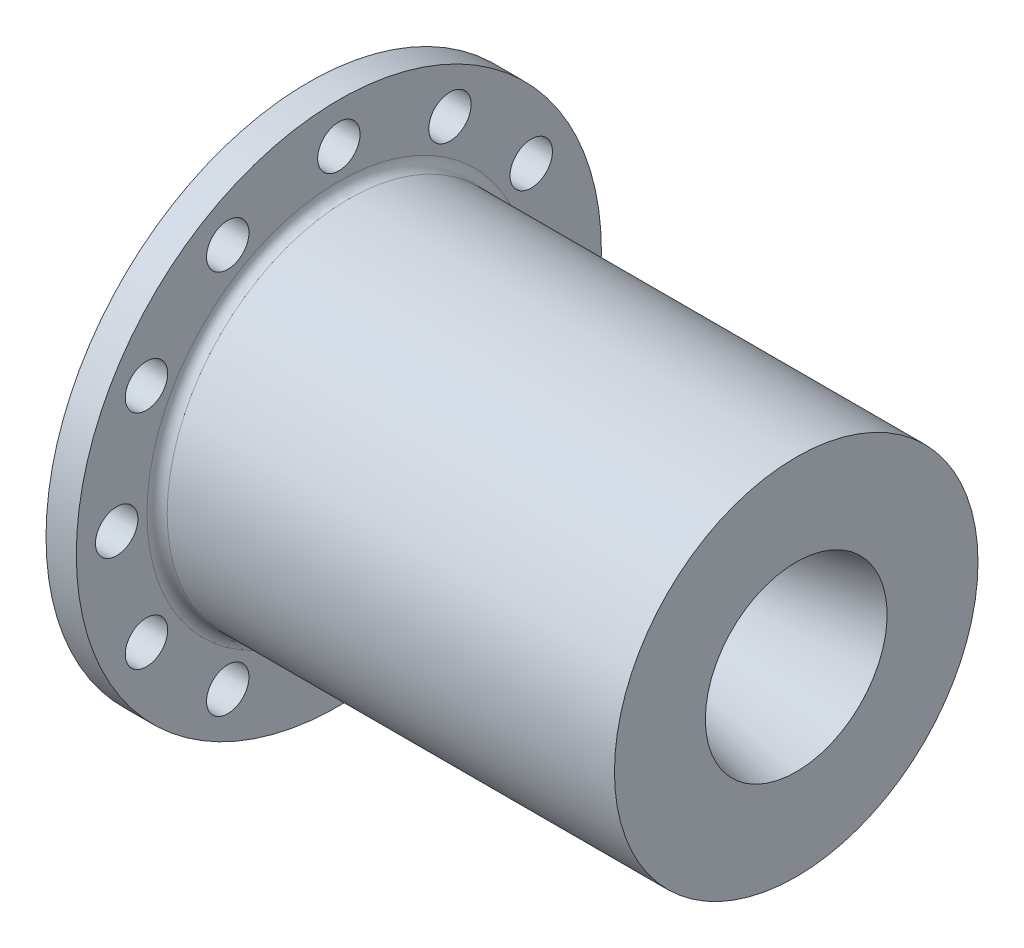
ISO-10303-21;
HEADER;
FILE_DESCRIPTION(('STEP AP214'),'2;1');
FILE_NAME('part.step','',(''),(''),'','','');
FILE_SCHEMA(('AUTOMOTIVE_DESIGN { 1 0 10303 214 1 1 1 1 }'));
ENDSEC;
DATA;
#1=APPLICATION_CONTEXT('core data for automotive mechanical design processes');
#2=APPLICATION_PROTOCOL_DEFINITION('international standard','automotive_design',2000,#1);
#3=PRODUCT_CONTEXT('',#1,'mechanical');
#4=PRODUCT('Part','Part','',(#3));
#5=PRODUCT_RELATED_PRODUCT_CATEGORY('part','',(#4));
#6=PRODUCT_DEFINITION_FORMATION('','',#4);
#7=PRODUCT_DEFINITION_CONTEXT('part definition',#1,'design');
#8=PRODUCT_DEFINITION('design','',#6,#7);
#9=PRODUCT_DEFINITION_SHAPE('','',#8);
#10=(LENGTH_UNIT() NAMED_UNIT(*) SI_UNIT(.MILLI.,.METRE.));
#11=(NAMED_UNIT(*) PLANE_ANGLE_UNIT() SI_UNIT($,.RADIAN.));
#12=(NAMED_UNIT(*) SI_UNIT($,.STERADIAN.) SOLID_ANGLE_UNIT());
#13=UNCERTAINTY_MEASURE_WITH_UNIT(LENGTH_MEASURE(1.E-05),#10,'distance_accuracy_value','');
#14=(GEOMETRIC_REPRESENTATION_CONTEXT(3) GLOBAL_UNCERTAINTY_ASSIGNED_CONTEXT((#13)) GLOBAL_UNIT_ASSIGNED_CONTEXT((#10,
#11,#12)) REPRESENTATION_CONTEXT('',''));
#15=CARTESIAN_POINT('',(0.,0.,0.));
#16=DIRECTION('',(0.,0.,1.));
#17=DIRECTION('',(1.,0.,0.));
#18=AXIS2_PLACEMENT_3D('',#15,#16,#17);
#19=CARTESIAN_POINT('',(3.81,33.02,0.));
#20=DIRECTION('',(-1.,0.,0.));
#21=DIRECTION('',(0.,0.,1.));
#22=AXIS2_PLACEMENT_3D('',#19,#20,#21);
#23=PLANE('',#22);
#24=CARTESIAN_POINT('',(3.81,13.9699999999999,-24.1967497817372));
#25=DIRECTION('',(-1.,0.,0.));
#26=DIRECTION('',(0.,0.,1.));
#27=AXIS2_PLACEMENT_3D('',#24,#25,#26);
#28=CIRCLE('',#27,2.667);
#29=CARTESIAN_POINT('',(3.81,13.9699999999999,-21.5297497817372));
#30=VERTEX_POINT('',#29);
#31=EDGE_CURVE('E103',#30,#30,#28,.F.);
#32=ORIENTED_EDGE('',*,*,#31,.F.);
#33=EDGE_LOOP('',(#32));
#34=FACE_BOUND('',#33,.T.);
#35=CARTESIAN_POINT('',(3.81,0.,-27.94));
#36=DIRECTION('',(-1.,0.,0.));
#37=DIRECTION('',(0.,0.,1.));
#38=AXIS2_PLACEMENT_3D('',#35,#36,#37);
#39=CIRCLE('',#38,2.667);
#40=CARTESIAN_POINT('',(3.81,0.,-25.273));
#41=VERTEX_POINT('',#40);
#42=EDGE_CURVE('E142',#41,#41,#39,.F.);
#43=ORIENTED_EDGE('',*,*,#42,.F.);
#44=EDGE_LOOP('',(#43));
#45=FACE_BOUND('',#44,.T.);
#46=CARTESIAN_POINT('',(3.81,-13.9700000000001,-24.1967497817372));
#47=DIRECTION('',(-1.,0.,0.));
#48=DIRECTION('',(0.,0.,1.));
#49=AXIS2_PLACEMENT_3D('',#46,#47,#48);
#50=CIRCLE('',#49,2.667);
#51=CARTESIAN_POINT('',(3.81,-13.9700000000001,-21.5297497817372));
#52=VERTEX_POINT('',#51);
#53=EDGE_CURVE('E136',#52,#52,#50,.F.);
#54=ORIENTED_EDGE('',*,*,#53,.F.);
#55=EDGE_LOOP('',(#54));
#56=FACE_BOUND('',#55,.T.);
#57=CARTESIAN_POINT('',(3.81,-24.1967497817373,-13.9699999999999));
#58=DIRECTION('',(-1.,0.,0.));
#59=DIRECTION('',(0.,0.,1.));
#60=AXIS2_PLACEMENT_3D('',#57,#58,#59);
#61=CIRCLE('',#60,2.667);
#62=CARTESIAN_POINT('',(3.81,-24.1967497817373,-11.3029999999999));
#63=VERTEX_POINT('',#62);
#64=EDGE_CURVE('E130',#63,#63,#61,.F.);
#65=ORIENTED_EDGE('',*,*,#64,.F.);
#66=EDGE_LOOP('',(#65));
#67=FACE_BOUND('',#66,.T.);
#68=CARTESIAN_POINT('',(3.81,-27.94,0.));
#69=DIRECTION('',(-1.,0.,0.));
#70=DIRECTION('',(0.,0.,1.));
#71=AXIS2_PLACEMENT_3D('',#68,#69,#70);
#72=CIRCLE('',#71,2.667);
#73=CARTESIAN_POINT('',(3.81,-27.94,2.667));
#74=VERTEX_POINT('',#73);
#75=EDGE_CURVE('E124',#74,#74,#72,.F.);
#76=ORIENTED_EDGE('',*,*,#75,.F.);
#77=EDGE_LOOP('',(#76));
#78=FACE_BOUND('',#77,.T.);
#79=CARTESIAN_POINT('',(3.81,-24.1967497817371,13.9700000000002));
#80=DIRECTION('',(-1.,0.,0.));
#81=DIRECTION('',(0.,0.,1.));
#82=AXIS2_PLACEMENT_3D('',#79,#80,#81);
#83=CIRCLE('',#82,2.667);
#84=CARTESIAN_POINT('',(3.81,-24.1967497817371,16.6370000000002));
#85=VERTEX_POINT('',#84);
#86=EDGE_CURVE('E118',#85,#85,#83,.F.);
#87=ORIENTED_EDGE('',*,*,#86,.F.);
#88=EDGE_LOOP('',(#87));
#89=FACE_BOUND('',#88,.T.);
#90=CARTESIAN_POINT('',(3.81,-13.9699999999998,24.1967497817373));
#91=DIRECTION('',(-1.,0.,0.));
#92=DIRECTION('',(0.,0.,1.));
#93=AXIS2_PLACEMENT_3D('',#90,#91,#92);
#94=CIRCLE('',#93,2.667);
#95=CARTESIAN_POINT('',(3.81,-13.9699999999998,26.8637497817373));
#96=VERTEX_POINT('',#95);
#97=EDGE_CURVE('E112',#96,#96,#94,.F.);
#98=ORIENTED_EDGE('',*,*,#97,.F.);
#99=EDGE_LOOP('',(#98));
#100=FACE_BOUND('',#99,.T.);
#101=CARTESIAN_POINT('',(3.81,2.92655965821831E-13,27.94));
#102=DIRECTION('',(-1.,0.,0.));
#103=DIRECTION('',(0.,0.,1.));
#104=AXIS2_PLACEMENT_3D('',#101,#102,#103);
#105=CIRCLE('',#104,2.667);
#106=CARTESIAN_POINT('',(3.81,2.92655965821831E-13,30.607));
#107=VERTEX_POINT('',#106);
#108=EDGE_CURVE('E104',#107,#107,#105,.F.);
#109=ORIENTED_EDGE('',*,*,#108,.F.);
#110=EDGE_LOOP('',(#109));
#111=FACE_BOUND('',#110,.T.);
#112=CARTESIAN_POINT('',(3.81,13.9700000000003,24.1967497817371));
#113=DIRECTION('',(-1.,0.,0.));
#114=DIRECTION('',(0.,0.,1.));
#115=AXIS2_PLACEMENT_3D('',#112,#113,#114);
#116=CIRCLE('',#115,2.667);
#117=CARTESIAN_POINT('',(3.81,13.9700000000003,26.8637497817371));
#118=VERTEX_POINT('',#117);
#119=EDGE_CURVE('E111',#118,#118,#116,.F.);
#120=ORIENTED_EDGE('',*,*,#119,.F.);
#121=EDGE_LOOP('',(#120));
#122=FACE_BOUND('',#121,.T.);
#123=CARTESIAN_POINT('',(3.81,24.1967497817374,13.9699999999997));
#124=DIRECTION('',(-1.,0.,0.));
#125=DIRECTION('',(0.,0.,1.));
#126=AXIS2_PLACEMENT_3D('',#123,#124,#125);
#127=CIRCLE('',#126,2.667);
#128=CARTESIAN_POINT('',(3.81,24.1967497817374,16.6369999999997));
#129=VERTEX_POINT('',#128);
#130=EDGE_CURVE('E152',#129,#129,#127,.F.);
#131=ORIENTED_EDGE('',*,*,#130,.F.);
#132=EDGE_LOOP('',(#131));
#133=FACE_BOUND('',#132,.T.);
#134=CARTESIAN_POINT('',(3.81,24.1967497817372,-13.97));
#135=DIRECTION('',(-1.,0.,0.));
#136=DIRECTION('',(0.,0.,1.));
#137=AXIS2_PLACEMENT_3D('',#134,#135,#136);
#138=CIRCLE('',#137,2.667);
#139=CARTESIAN_POINT('',(3.81,24.1967497817372,-11.303));
#140=VERTEX_POINT('',#139);
#141=EDGE_CURVE('E97',#140,#140,#138,.F.);
#142=ORIENTED_EDGE('',*,*,#141,.F.);
#143=EDGE_LOOP('',(#142));
#144=FACE_BOUND('',#143,.T.);
#145=CARTESIAN_POINT('',(3.81,27.94,0.));
#146=DIRECTION('',(-1.,0.,0.));
#147=DIRECTION('',(0.,0.,1.));
#148=AXIS2_PLACEMENT_3D('',#145,#146,#147);
#149=CIRCLE('',#148,2.667);
#150=CARTESIAN_POINT('',(3.81,27.94,2.667));
#151=VERTEX_POINT('',#150);
#152=EDGE_CURVE('E91',#151,#151,#149,.F.);
#153=ORIENTED_EDGE('',*,*,#152,.F.);
#154=EDGE_LOOP('',(#153));
#155=FACE_BOUND('',#154,.T.);
#156=CARTESIAN_POINT('',(3.81,0.,0.));
#157=DIRECTION('',(-1.,0.,0.));
#158=DIRECTION('',(0.,0.,1.));
#159=AXIS2_PLACEMENT_3D('',#156,#157,#158);
#160=CIRCLE('',#159,24.13);
#161=CARTESIAN_POINT('',(3.81,0.,24.13));
#162=VERTEX_POINT('',#161);
#163=EDGE_CURVE('E58',#162,#162,#160,.T.);
#164=ORIENTED_EDGE('',*,*,#163,.T.);
#165=EDGE_LOOP('',(#164));
#166=FACE_BOUND('',#165,.T.);
#167=CARTESIAN_POINT('',(3.81,0.,0.));
#168=DIRECTION('',(-1.,0.,0.));
#169=DIRECTION('',(0.,0.,1.));
#170=AXIS2_PLACEMENT_3D('',#167,#168,#169);
#171=CIRCLE('',#170,33.02);
#172=CARTESIAN_POINT('',(3.81,0.,33.02));
#173=VERTEX_POINT('',#172);
#174=EDGE_CURVE('E61',#173,#173,#171,.T.);
#175=ORIENTED_EDGE('',*,*,#174,.F.);
#176=EDGE_LOOP('',(#175));
#177=FACE_BOUND('',#176,.T.);
#178=ADVANCED_FACE('F35',(#34,#45,#56,#67,#78,#89,#100,#111,#122,#133,#144,#155,#166,#177),#23,.F.);
#179=CARTESIAN_POINT('',(0.,0.,0.));
#180=DIRECTION('',(-1.,0.,0.));
#181=DIRECTION('',(0.,0.,1.));
#182=AXIS2_PLACEMENT_3D('',#179,#180,#181);
#183=CYLINDRICAL_SURFACE('',#182,33.02);
#184=CARTESIAN_POINT('',(0.,0.,0.));
#185=DIRECTION('',(-1.,0.,0.));
#186=DIRECTION('',(0.,0.,1.));
#187=AXIS2_PLACEMENT_3D('',#184,#185,#186);
#188=CIRCLE('',#187,33.02);
#189=CARTESIAN_POINT('',(0.,0.,33.02));
#190=VERTEX_POINT('',#189);
#191=EDGE_CURVE('E64',#190,#190,#188,.T.);
#192=ORIENTED_EDGE('',*,*,#191,.F.);
#193=EDGE_LOOP('',(#192));
#194=FACE_BOUND('',#193,.T.);
#195=ORIENTED_EDGE('',*,*,#174,.T.);
#196=EDGE_LOOP('',(#195));
#197=FACE_BOUND('',#196,.T.);
#198=ADVANCED_FACE('F171',(#194,#197),#183,.T.);
#199=CARTESIAN_POINT('',(0.,21.844,0.));
#200=DIRECTION('',(1.,0.,0.));
#201=DIRECTION('',(0.,0.,-1.));
#202=AXIS2_PLACEMENT_3D('',#199,#200,#201);
#203=PLANE('',#202);
#204=CARTESIAN_POINT('',(0.,13.9699999999999,-24.1967497817372));
#205=DIRECTION('',(-1.,0.,0.));
#206=DIRECTION('',(0.,0.86602540378444,0.499999999999998));
#207=AXIS2_PLACEMENT_3D('',#204,#205,#206);
#208=CIRCLE('',#207,2.667);
#209=CARTESIAN_POINT('',(0.,16.279689751893,-22.8632497817373));
#210=VERTEX_POINT('',#209);
#211=EDGE_CURVE('E145',#210,#210,#208,.T.);
#212=ORIENTED_EDGE('',*,*,#211,.F.);
#213=EDGE_LOOP('',(#212));
#214=FACE_BOUND('',#213,.T.);
#215=CARTESIAN_POINT('',(0.,0.,-27.94));
#216=DIRECTION('',(-1.,0.,0.));
#217=DIRECTION('',(0.,1.,0.));
#218=AXIS2_PLACEMENT_3D('',#215,#216,#217);
#219=CIRCLE('',#218,2.667);
#220=CARTESIAN_POINT('',(0.,2.6669999999999,-27.94));
#221=VERTEX_POINT('',#220);
#222=EDGE_CURVE('E139',#221,#221,#219,.T.);
#223=ORIENTED_EDGE('',*,*,#222,.F.);
#224=EDGE_LOOP('',(#223));
#225=FACE_BOUND('',#224,.T.);
#226=CARTESIAN_POINT('',(0.,-13.9700000000001,-24.1967497817372));
#227=DIRECTION('',(-1.,0.,0.));
#228=DIRECTION('',(0.,0.866025403784436,-0.500000000000004));
#229=AXIS2_PLACEMENT_3D('',#226,#227,#228);
#230=CIRCLE('',#229,2.667);
#231=CARTESIAN_POINT('',(0.,-11.660310248107,-25.5302497817372));
#232=VERTEX_POINT('',#231);
#233=EDGE_CURVE('E133',#232,#232,#230,.T.);
#234=ORIENTED_EDGE('',*,*,#233,.F.);
#235=EDGE_LOOP('',(#234));
#236=FACE_BOUND('',#235,.T.);
#237=CARTESIAN_POINT('',(0.,-24.1967497817373,-13.9699999999999));
#238=DIRECTION('',(-1.,0.,0.));
#239=DIRECTION('',(0.,0.499999999999995,-0.866025403784442));
#240=AXIS2_PLACEMENT_3D('',#237,#238,#239);
#241=CIRCLE('',#240,2.667);
#242=CARTESIAN_POINT('',(0.,-22.8632497817373,-16.279689751893));
#243=VERTEX_POINT('',#242);
#244=EDGE_CURVE('E127',#243,#243,#241,.T.);
#245=ORIENTED_EDGE('',*,*,#244,.F.);
#246=EDGE_LOOP('',(#245));
#247=FACE_BOUND('',#246,.T.);
#248=CARTESIAN_POINT('',(0.,-27.94,0.));
#249=DIRECTION('',(-1.,0.,0.));
#250=DIRECTION('',(0.,0.,-1.));
#251=AXIS2_PLACEMENT_3D('',#248,#249,#250);
#252=CIRCLE('',#251,2.667);
#253=CARTESIAN_POINT('',(0.,-27.94,-2.667));
#254=VERTEX_POINT('',#253);
#255=EDGE_CURVE('E121',#254,#254,#252,.T.);
#256=ORIENTED_EDGE('',*,*,#255,.F.);
#257=EDGE_LOOP('',(#256));
#258=FACE_BOUND('',#257,.T.);
#259=CARTESIAN_POINT('',(0.,-24.1967497817371,13.9700000000002));
#260=DIRECTION('',(-1.,0.,0.));
#261=DIRECTION('',(0.,-0.500000000000007,-0.866025403784435));
#262=AXIS2_PLACEMENT_3D('',#259,#260,#261);
#263=CIRCLE('',#262,2.667);
#264=CARTESIAN_POINT('',(0.,-25.5302497817371,11.6603102481071));
#265=VERTEX_POINT('',#264);
#266=EDGE_CURVE('E115',#265,#265,#263,.T.);
#267=ORIENTED_EDGE('',*,*,#266,.F.);
#268=EDGE_LOOP('',(#267));
#269=FACE_BOUND('',#268,.T.);
#270=CARTESIAN_POINT('',(0.,-13.9699999999998,24.1967497817373));
#271=DIRECTION('',(-1.,0.,0.));
#272=DIRECTION('',(0.,-0.866025403784443,-0.499999999999992));
#273=AXIS2_PLACEMENT_3D('',#270,#271,#272);
#274=CIRCLE('',#273,2.667);
#275=CARTESIAN_POINT('',(0.,-16.2796897518929,22.8632497817374));
#276=VERTEX_POINT('',#275);
#277=EDGE_CURVE('E107',#276,#276,#274,.T.);
#278=ORIENTED_EDGE('',*,*,#277,.F.);
#279=EDGE_LOOP('',(#278));
#280=FACE_BOUND('',#279,.T.);
#281=CARTESIAN_POINT('',(0.,2.92655965821831E-13,27.94));
#282=DIRECTION('',(-1.,0.,0.));
#283=DIRECTION('',(0.,-1.,0.));
#284=AXIS2_PLACEMENT_3D('',#281,#282,#283);
#285=CIRCLE('',#284,2.667);
#286=CARTESIAN_POINT('',(0.,-2.66699999999971,27.94));
#287=VERTEX_POINT('',#286);
#288=EDGE_CURVE('E108',#287,#287,#285,.T.);
#289=ORIENTED_EDGE('',*,*,#288,.F.);
#290=EDGE_LOOP('',(#289));
#291=FACE_BOUND('',#290,.T.);
#292=CARTESIAN_POINT('',(0.,13.9700000000003,24.1967497817371));
#293=DIRECTION('',(-1.,0.,0.));
#294=DIRECTION('',(0.,-0.866025403784433,0.50000000000001));
#295=AXIS2_PLACEMENT_3D('',#292,#293,#294);
#296=CIRCLE('',#295,2.667);
#297=CARTESIAN_POINT('',(0.,11.6603102481072,25.5302497817371));
#298=VERTEX_POINT('',#297);
#299=EDGE_CURVE('E155',#298,#298,#296,.T.);
#300=ORIENTED_EDGE('',*,*,#299,.F.);
#301=EDGE_LOOP('',(#300));
#302=FACE_BOUND('',#301,.T.);
#303=CARTESIAN_POINT('',(0.,24.1967497817374,13.9699999999997));
#304=DIRECTION('',(-1.,0.,0.));
#305=DIRECTION('',(0.,-0.499999999999989,0.866025403784445));
#306=AXIS2_PLACEMENT_3D('',#303,#304,#305);
#307=CIRCLE('',#306,2.667);
#308=CARTESIAN_POINT('',(0.,22.8632497817374,16.2796897518928));
#309=VERTEX_POINT('',#308);
#310=EDGE_CURVE('E156',#309,#309,#307,.T.);
#311=ORIENTED_EDGE('',*,*,#310,.F.);
#312=EDGE_LOOP('',(#311));
#313=FACE_BOUND('',#312,.T.);
#314=CARTESIAN_POINT('',(0.,24.1967497817372,-13.97));
#315=DIRECTION('',(-1.,0.,0.));
#316=DIRECTION('',(0.,0.500000000000001,0.866025403784438));
#317=AXIS2_PLACEMENT_3D('',#314,#315,#316);
#318=CIRCLE('',#317,2.667);
#319=CARTESIAN_POINT('',(0.,25.5302497817372,-11.6603102481069));
#320=VERTEX_POINT('',#319);
#321=EDGE_CURVE('E100',#320,#320,#318,.T.);
#322=ORIENTED_EDGE('',*,*,#321,.F.);
#323=EDGE_LOOP('',(#322));
#324=FACE_BOUND('',#323,.T.);
#325=CARTESIAN_POINT('',(0.,27.94,0.));
#326=DIRECTION('',(-1.,0.,0.));
#327=DIRECTION('',(0.,0.,1.));
#328=AXIS2_PLACEMENT_3D('',#325,#326,#327);
#329=CIRCLE('',#328,2.667);
#330=CARTESIAN_POINT('',(0.,27.94,2.667));
#331=VERTEX_POINT('',#330);
#332=EDGE_CURVE('E94',#331,#331,#329,.T.);
#333=ORIENTED_EDGE('',*,*,#332,.F.);
#334=EDGE_LOOP('',(#333));
#335=FACE_BOUND('',#334,.T.);
#336=CARTESIAN_POINT('',(0.,0.,0.));
#337=DIRECTION('',(-1.,0.,0.));
#338=DIRECTION('',(0.,0.,1.));
#339=AXIS2_PLACEMENT_3D('',#336,#337,#338);
#340=CIRCLE('',#339,21.844);
#341=CARTESIAN_POINT('',(0.,0.,21.844));
#342=VERTEX_POINT('',#341);
#343=EDGE_CURVE('E67',#342,#342,#340,.T.);
#344=ORIENTED_EDGE('',*,*,#343,.F.);
#345=EDGE_LOOP('',(#344));
#346=FACE_BOUND('',#345,.T.);
#347=ORIENTED_EDGE('',*,*,#191,.T.);
#348=EDGE_LOOP('',(#347));
#349=FACE_BOUND('',#348,.T.);
#350=ADVANCED_FACE('F167',(#214,#225,#236,#247,#258,#269,#280,#291,#302,#313,#324,#335,#346,
#349),#203,.F.);
#351=CARTESIAN_POINT('',(0.,0.,0.));
#352=DIRECTION('',(-1.,0.,0.));
#353=DIRECTION('',(0.,0.,1.));
#354=AXIS2_PLACEMENT_3D('',#351,#352,#353);
#355=CYLINDRICAL_SURFACE('',#354,21.844);
#356=CARTESIAN_POINT('',(0.762,0.,0.));
#357=DIRECTION('',(1.,0.,0.));
#358=DIRECTION('',(0.,0.,-1.));
#359=AXIS2_PLACEMENT_3D('',#356,#357,#358);
#360=CIRCLE('',#359,21.844);
#361=CARTESIAN_POINT('',(0.762,0.,-21.844));
#362=VERTEX_POINT('',#361);
#363=EDGE_CURVE('E10',#362,#362,#360,.T.);
#364=ORIENTED_EDGE('',*,*,#363,.T.);
#365=EDGE_LOOP('',(#364));
#366=FACE_BOUND('',#365,.T.);
#367=ORIENTED_EDGE('',*,*,#343,.T.);
#368=EDGE_LOOP('',(#367));
#369=FACE_BOUND('',#368,.T.);
#370=ADVANCED_FACE('F170',(#366,#369),#355,.F.);
#371=CARTESIAN_POINT('',(1.016,19.304,0.));
#372=DIRECTION('',(1.,0.,0.));
#373=DIRECTION('',(0.,0.,-1.));
#374=AXIS2_PLACEMENT_3D('',#371,#372,#373);
#375=PLANE('',#374);
#376=CARTESIAN_POINT('',(1.016,0.,0.));
#377=DIRECTION('',(1.,0.,0.));
#378=DIRECTION('',(0.,0.,-1.));
#379=AXIS2_PLACEMENT_3D('',#376,#377,#378);
#380=CIRCLE('',#379,19.558);
#381=CARTESIAN_POINT('',(1.016,0.,-19.558));
#382=VERTEX_POINT('',#381);
#383=EDGE_CURVE('E42',#382,#382,#380,.T.);
#384=ORIENTED_EDGE('',*,*,#383,.T.);
#385=EDGE_LOOP('',(#384));
#386=FACE_BOUND('',#385,.T.);
#387=CARTESIAN_POINT('',(1.016,0.,0.));
#388=DIRECTION('',(1.,0.,0.));
#389=DIRECTION('',(0.,0.,-1.));
#390=AXIS2_PLACEMENT_3D('',#387,#388,#389);
#391=CIRCLE('',#390,21.59);
#392=CARTESIAN_POINT('',(1.016,0.,-21.59));
#393=VERTEX_POINT('',#392);
#394=EDGE_CURVE('E46',#393,#393,#391,.F.);
#395=ORIENTED_EDGE('',*,*,#394,.T.);
#396=EDGE_LOOP('',(#395));
#397=FACE_BOUND('',#396,.T.);
#398=ADVANCED_FACE('F221',(#386,#397),#375,.F.);
#399=CARTESIAN_POINT('',(0.,0.,0.));
#400=DIRECTION('',(-1.,0.,0.));
#401=DIRECTION('',(0.,0.,1.));
#402=AXIS2_PLACEMENT_3D('',#399,#400,#401);
#403=CYLINDRICAL_SURFACE('',#402,19.304);
#404=CARTESIAN_POINT('',(0.762,0.,0.));
#405=DIRECTION('',(1.,0.,0.));
#406=DIRECTION('',(0.,0.,-1.));
#407=AXIS2_PLACEMENT_3D('',#404,#405,#406);
#408=CIRCLE('',#407,19.304);
#409=CARTESIAN_POINT('',(0.762,0.,-19.304));
#410=VERTEX_POINT('',#409);
#411=EDGE_CURVE('E50',#410,#410,#408,.F.);
#412=ORIENTED_EDGE('',*,*,#411,.T.);
#413=EDGE_LOOP('',(#412));
#414=FACE_BOUND('',#413,.T.);
#415=CARTESIAN_POINT('',(0.,0.,0.));
#416=DIRECTION('',(-1.,0.,0.));
#417=DIRECTION('',(0.,0.,1.));
#418=AXIS2_PLACEMENT_3D('',#415,#416,#417);
#419=CIRCLE('',#418,19.304);
#420=CARTESIAN_POINT('',(0.,0.,19.304));
#421=VERTEX_POINT('',#420);
#422=EDGE_CURVE('E70',#421,#421,#419,.T.);
#423=ORIENTED_EDGE('',*,*,#422,.F.);
#424=EDGE_LOOP('',(#423));
#425=FACE_BOUND('',#424,.T.);
#426=ADVANCED_FACE('F217',(#414,#425),#403,.T.);
#427=CARTESIAN_POINT('',(0.,15.24,0.));
#428=DIRECTION('',(1.,0.,0.));
#429=DIRECTION('',(0.,0.,-1.));
#430=AXIS2_PLACEMENT_3D('',#427,#428,#429);
#431=PLANE('',#430);
#432=CARTESIAN_POINT('',(0.,0.,0.));
#433=DIRECTION('',(-1.,0.,0.));
#434=DIRECTION('',(0.,0.,1.));
#435=AXIS2_PLACEMENT_3D('',#432,#433,#434);
#436=CIRCLE('',#435,15.24);
#437=CARTESIAN_POINT('',(0.,0.,15.24));
#438=VERTEX_POINT('',#437);
#439=EDGE_CURVE('E73',#438,#438,#436,.T.);
#440=ORIENTED_EDGE('',*,*,#439,.F.);
#441=EDGE_LOOP('',(#440));
#442=FACE_BOUND('',#441,.T.);
#443=ORIENTED_EDGE('',*,*,#422,.T.);
#444=EDGE_LOOP('',(#443));
#445=FACE_BOUND('',#444,.T.);
#446=ADVANCED_FACE('F220',(#442,#445),#431,.F.);
#447=CARTESIAN_POINT('',(0.,0.,0.));
#448=DIRECTION('',(-1.,0.,0.));
#449=DIRECTION('',(0.,0.,1.));
#450=AXIS2_PLACEMENT_3D('',#447,#448,#449);
#451=CYLINDRICAL_SURFACE('',#450,15.24);
#452=CARTESIAN_POINT('',(38.1,0.,0.));
#453=DIRECTION('',(-1.,0.,0.));
#454=DIRECTION('',(0.,0.,1.));
#455=AXIS2_PLACEMENT_3D('',#452,#453,#454);
#456=CIRCLE('',#455,15.24);
#457=CARTESIAN_POINT('',(38.1,0.,15.24));
#458=VERTEX_POINT('',#457);
#459=EDGE_CURVE('E76',#458,#458,#456,.T.);
#460=ORIENTED_EDGE('',*,*,#459,.F.);
#461=EDGE_LOOP('',(#460));
#462=FACE_BOUND('',#461,.T.);
#463=ORIENTED_EDGE('',*,*,#439,.T.);
#464=EDGE_LOOP('',(#463));
#465=FACE_BOUND('',#464,.T.);
#466=ADVANCED_FACE('F226',(#462,#465),#451,.F.);
#467=CARTESIAN_POINT('',(38.1,0.,0.));
#468=DIRECTION('',(-1.,0.,0.));
#469=DIRECTION('',(0.,0.,1.));
#470=AXIS2_PLACEMENT_3D('',#467,#468,#469);
#471=CONICAL_SURFACE('',#470,15.24,1.13446401379631);
#472=CARTESIAN_POINT('',(41.6739917305461,0.,0.));
#473=DIRECTION('',(-1.,0.,0.));
#474=DIRECTION('',(0.,0.,1.));
#475=AXIS2_PLACEMENT_3D('',#472,#473,#474);
#476=CIRCLE('',#475,7.57555);
#477=CARTESIAN_POINT('',(41.6739917305461,0.,7.57555));
#478=VERTEX_POINT('',#477);
#479=EDGE_CURVE('E79',#478,#478,#476,.T.);
#480=ORIENTED_EDGE('',*,*,#479,.F.);
#481=EDGE_LOOP('',(#480));
#482=FACE_BOUND('',#481,.T.);
#483=ORIENTED_EDGE('',*,*,#459,.T.);
#484=EDGE_LOOP('',(#483));
#485=FACE_BOUND('',#484,.T.);
#486=ADVANCED_FACE('F232',(#482,#485),#471,.F.);
#487=CARTESIAN_POINT('',(0.,0.,0.));
#488=DIRECTION('',(-1.,0.,0.));
#489=DIRECTION('',(0.,0.,1.));
#490=AXIS2_PLACEMENT_3D('',#487,#488,#489);
#491=CYLINDRICAL_SURFACE('',#490,7.57555);
#492=CARTESIAN_POINT('',(43.1979917305461,0.,0.));
#493=DIRECTION('',(-1.,0.,0.));
#494=DIRECTION('',(0.,0.,1.));
#495=AXIS2_PLACEMENT_3D('',#492,#493,#494);
#496=CIRCLE('',#495,7.57555);
#497=CARTESIAN_POINT('',(43.1979917305461,0.,7.57555));
#498=VERTEX_POINT('',#497);
#499=EDGE_CURVE('E82',#498,#498,#496,.T.);
#500=ORIENTED_EDGE('',*,*,#499,.F.);
#501=EDGE_LOOP('',(#500));
#502=FACE_BOUND('',#501,.T.);
#503=ORIENTED_EDGE('',*,*,#479,.T.);
#504=EDGE_LOOP('',(#503));
#505=FACE_BOUND('',#504,.T.);
#506=ADVANCED_FACE('F417',(#502,#505),#491,.F.);
#507=CARTESIAN_POINT('',(43.1979917305461,0.,0.));
#508=DIRECTION('',(1.,0.,0.));
#509=DIRECTION('',(0.,0.,-1.));
#510=AXIS2_PLACEMENT_3D('',#507,#508,#509);
#511=CONICAL_SURFACE('',#510,7.57555,0.209439510239313);
#512=CARTESIAN_POINT('',(61.3317532560259,0.,0.));
#513=DIRECTION('',(-1.,0.,0.));
#514=DIRECTION('',(0.,0.,1.));
#515=AXIS2_PLACEMENT_3D('',#512,#513,#514);
#516=CIRCLE('',#515,11.43);
#517=CARTESIAN_POINT('',(61.3317532560259,0.,11.43));
#518=VERTEX_POINT('',#517);
#519=EDGE_CURVE('E85',#518,#518,#516,.T.);
#520=ORIENTED_EDGE('',*,*,#519,.F.);
#521=EDGE_LOOP('',(#520));
#522=FACE_BOUND('',#521,.T.);
#523=ORIENTED_EDGE('',*,*,#499,.T.);
#524=EDGE_LOOP('',(#523));
#525=FACE_BOUND('',#524,.T.);
#526=ADVANCED_FACE('F407',(#522,#525),#511,.F.);
#527=CARTESIAN_POINT('',(61.3317532560259,22.86,0.));
#528=DIRECTION('',(-1.,0.,0.));
#529=DIRECTION('',(0.,0.,1.));
#530=AXIS2_PLACEMENT_3D('',#527,#528,#529);
#531=PLANE('',#530);
#532=CARTESIAN_POINT('',(61.3317532560259,0.,0.));
#533=DIRECTION('',(-1.,0.,0.));
#534=DIRECTION('',(0.,0.,1.));
#535=AXIS2_PLACEMENT_3D('',#532,#533,#534);
#536=CIRCLE('',#535,22.86);
#537=CARTESIAN_POINT('',(61.3317532560259,0.,22.86));
#538=VERTEX_POINT('',#537);
#539=EDGE_CURVE('E88',#538,#538,#536,.T.);
#540=ORIENTED_EDGE('',*,*,#539,.F.);
#541=EDGE_LOOP('',(#540));
#542=FACE_BOUND('',#541,.T.);
#543=ORIENTED_EDGE('',*,*,#519,.T.);
#544=EDGE_LOOP('',(#543));
#545=FACE_BOUND('',#544,.T.);
#546=ADVANCED_FACE('F397',(#542,#545),#531,.F.);
#547=CARTESIAN_POINT('',(0.,0.,0.));
#548=DIRECTION('',(-1.,0.,0.));
#549=DIRECTION('',(0.,0.,1.));
#550=AXIS2_PLACEMENT_3D('',#547,#548,#549);
#551=CYLINDRICAL_SURFACE('',#550,22.86);
#552=CARTESIAN_POINT('',(5.08,0.,0.));
#553=DIRECTION('',(-1.,0.,0.));
#554=DIRECTION('',(0.,0.,1.));
#555=AXIS2_PLACEMENT_3D('',#552,#553,#554);
#556=CIRCLE('',#555,22.86);
#557=CARTESIAN_POINT('',(5.08,0.,22.86));
#558=VERTEX_POINT('',#557);
#559=EDGE_CURVE('E55',#558,#558,#556,.F.);
#560=ORIENTED_EDGE('',*,*,#559,.T.);
#561=EDGE_LOOP('',(#560));
#562=FACE_BOUND('',#561,.T.);
#563=ORIENTED_EDGE('',*,*,#539,.T.);
#564=EDGE_LOOP('',(#563));
#565=FACE_BOUND('',#564,.T.);
#566=ADVANCED_FACE('F200',(#562,#565),#551,.T.);
#567=CARTESIAN_POINT('',(5.08,0.,0.));
#568=DIRECTION('',(-1.,0.,0.));
#569=DIRECTION('',(0.,0.,1.));
#570=AXIS2_PLACEMENT_3D('',#567,#568,#569);
#571=TOROIDAL_SURFACE('',#570,24.13,1.27);
#572=ORIENTED_EDGE('',*,*,#559,.F.);
#573=EDGE_LOOP('',(#572));
#574=FACE_BOUND('',#573,.T.);
#575=ORIENTED_EDGE('',*,*,#163,.F.);
#576=EDGE_LOOP('',(#575));
#577=FACE_BOUND('',#576,.T.);
#578=ADVANCED_FACE('F197',(#574,#577),#571,.F.);
#579=CARTESIAN_POINT('',(61.3327532560259,27.94,0.));
#580=DIRECTION('',(-1.,0.,0.));
#581=DIRECTION('',(0.,0.,1.));
#582=AXIS2_PLACEMENT_3D('',#579,#580,#581);
#583=CYLINDRICAL_SURFACE('',#582,2.667);
#584=ORIENTED_EDGE('',*,*,#332,.T.);
#585=EDGE_LOOP('',(#584));
#586=FACE_BOUND('',#585,.T.);
#587=ORIENTED_EDGE('',*,*,#152,.T.);
#588=EDGE_LOOP('',(#587));
#589=FACE_BOUND('',#588,.T.);
#590=ADVANCED_FACE('F199',(#586,#589),#583,.F.);
#591=CARTESIAN_POINT('',(61.3327532560259,24.1967497817372,-13.97));
#592=DIRECTION('',(-1.,0.,0.));
#593=DIRECTION('',(0.,0.,1.));
#594=AXIS2_PLACEMENT_3D('',#591,#592,#593);
#595=CYLINDRICAL_SURFACE('',#594,2.667);
#596=ORIENTED_EDGE('',*,*,#321,.T.);
#597=EDGE_LOOP('',(#596));
#598=FACE_BOUND('',#597,.T.);
#599=ORIENTED_EDGE('',*,*,#141,.T.);
#600=EDGE_LOOP('',(#599));
#601=FACE_BOUND('',#600,.T.);
#602=ADVANCED_FACE('F363',(#598,#601),#595,.F.);
#603=CARTESIAN_POINT('',(61.3327532560259,24.1967497817374,13.9699999999997));
#604=DIRECTION('',(-1.,0.,0.));
#605=DIRECTION('',(0.,0.,1.));
#606=AXIS2_PLACEMENT_3D('',#603,#604,#605);
#607=CYLINDRICAL_SURFACE('',#606,2.667);
#608=ORIENTED_EDGE('',*,*,#310,.T.);
#609=EDGE_LOOP('',(#608));
#610=FACE_BOUND('',#609,.T.);
#611=ORIENTED_EDGE('',*,*,#130,.T.);
#612=EDGE_LOOP('',(#611));
#613=FACE_BOUND('',#612,.T.);
#614=ADVANCED_FACE('F354',(#610,#613),#607,.F.);
#615=CARTESIAN_POINT('',(61.3327532560259,13.9700000000003,24.1967497817371));
#616=DIRECTION('',(-1.,0.,0.));
#617=DIRECTION('',(0.,0.,1.));
#618=AXIS2_PLACEMENT_3D('',#615,#616,#617);
#619=CYLINDRICAL_SURFACE('',#618,2.667);
#620=ORIENTED_EDGE('',*,*,#299,.T.);
#621=EDGE_LOOP('',(#620));
#622=FACE_BOUND('',#621,.T.);
#623=ORIENTED_EDGE('',*,*,#119,.T.);
#624=EDGE_LOOP('',(#623));
#625=FACE_BOUND('',#624,.T.);
#626=ADVANCED_FACE('F164',(#622,#625),#619,.F.);
#627=CARTESIAN_POINT('',(61.3327532560259,2.92655965821831E-13,27.94));
#628=DIRECTION('',(-1.,0.,0.));
#629=DIRECTION('',(0.,0.,1.));
#630=AXIS2_PLACEMENT_3D('',#627,#628,#629);
#631=CYLINDRICAL_SURFACE('',#630,2.667);
#632=ORIENTED_EDGE('',*,*,#288,.T.);
#633=EDGE_LOOP('',(#632));
#634=FACE_BOUND('',#633,.T.);
#635=ORIENTED_EDGE('',*,*,#108,.T.);
#636=EDGE_LOOP('',(#635));
#637=FACE_BOUND('',#636,.T.);
#638=ADVANCED_FACE('F335',(#634,#637),#631,.F.);
#639=CARTESIAN_POINT('',(61.3327532560259,-13.9699999999998,24.1967497817373));
#640=DIRECTION('',(-1.,0.,0.));
#641=DIRECTION('',(0.,0.,1.));
#642=AXIS2_PLACEMENT_3D('',#639,#640,#641);
#643=CYLINDRICAL_SURFACE('',#642,2.667);
#644=ORIENTED_EDGE('',*,*,#277,.T.);
#645=EDGE_LOOP('',(#644));
#646=FACE_BOUND('',#645,.T.);
#647=ORIENTED_EDGE('',*,*,#97,.T.);
#648=EDGE_LOOP('',(#647));
#649=FACE_BOUND('',#648,.T.);
#650=ADVANCED_FACE('F325',(#646,#649),#643,.F.);
#651=CARTESIAN_POINT('',(61.3327532560259,-24.1967497817371,13.9700000000002));
#652=DIRECTION('',(-1.,0.,0.));
#653=DIRECTION('',(0.,0.,1.));
#654=AXIS2_PLACEMENT_3D('',#651,#652,#653);
#655=CYLINDRICAL_SURFACE('',#654,2.667);
#656=ORIENTED_EDGE('',*,*,#266,.T.);
#657=EDGE_LOOP('',(#656));
#658=FACE_BOUND('',#657,.T.);
#659=ORIENTED_EDGE('',*,*,#86,.T.);
#660=EDGE_LOOP('',(#659));
#661=FACE_BOUND('',#660,.T.);
#662=ADVANCED_FACE('F315',(#658,#661),#655,.F.);
#663=CARTESIAN_POINT('',(61.3327532560259,-27.94,0.));
#664=DIRECTION('',(-1.,0.,0.));
#665=DIRECTION('',(0.,0.,1.));
#666=AXIS2_PLACEMENT_3D('',#663,#664,#665);
#667=CYLINDRICAL_SURFACE('',#666,2.667);
#668=ORIENTED_EDGE('',*,*,#255,.T.);
#669=EDGE_LOOP('',(#668));
#670=FACE_BOUND('',#669,.T.);
#671=ORIENTED_EDGE('',*,*,#75,.T.);
#672=EDGE_LOOP('',(#671));
#673=FACE_BOUND('',#672,.T.);
#674=ADVANCED_FACE('F305',(#670,#673),#667,.F.);
#675=CARTESIAN_POINT('',(61.3327532560259,-24.1967497817373,-13.9699999999999));
#676=DIRECTION('',(-1.,0.,0.));
#677=DIRECTION('',(0.,0.,1.));
#678=AXIS2_PLACEMENT_3D('',#675,#676,#677);
#679=CYLINDRICAL_SURFACE('',#678,2.667);
#680=ORIENTED_EDGE('',*,*,#244,.T.);
#681=EDGE_LOOP('',(#680));
#682=FACE_BOUND('',#681,.T.);
#683=ORIENTED_EDGE('',*,*,#64,.T.);
#684=EDGE_LOOP('',(#683));
#685=FACE_BOUND('',#684,.T.);
#686=ADVANCED_FACE('F295',(#682,#685),#679,.F.);
#687=CARTESIAN_POINT('',(61.3327532560259,-13.9700000000001,-24.1967497817372));
#688=DIRECTION('',(-1.,0.,0.));
#689=DIRECTION('',(0.,0.,1.));
#690=AXIS2_PLACEMENT_3D('',#687,#688,#689);
#691=CYLINDRICAL_SURFACE('',#690,2.667);
#692=ORIENTED_EDGE('',*,*,#233,.T.);
#693=EDGE_LOOP('',(#692));
#694=FACE_BOUND('',#693,.T.);
#695=ORIENTED_EDGE('',*,*,#53,.T.);
#696=EDGE_LOOP('',(#695));
#697=FACE_BOUND('',#696,.T.);
#698=ADVANCED_FACE('F285',(#694,#697),#691,.F.);
#699=CARTESIAN_POINT('',(61.3327532560259,0.,-27.94));
#700=DIRECTION('',(-1.,0.,0.));
#701=DIRECTION('',(0.,0.,1.));
#702=AXIS2_PLACEMENT_3D('',#699,#700,#701);
#703=CYLINDRICAL_SURFACE('',#702,2.667);
#704=ORIENTED_EDGE('',*,*,#222,.T.);
#705=EDGE_LOOP('',(#704));
#706=FACE_BOUND('',#705,.T.);
#707=ORIENTED_EDGE('',*,*,#42,.T.);
#708=EDGE_LOOP('',(#707));
#709=FACE_BOUND('',#708,.T.);
#710=ADVANCED_FACE('F211',(#706,#709),#703,.F.);
#711=CARTESIAN_POINT('',(61.3327532560259,13.9699999999999,-24.1967497817372));
#712=DIRECTION('',(-1.,0.,0.));
#713=DIRECTION('',(0.,0.,1.));
#714=AXIS2_PLACEMENT_3D('',#711,#712,#713);
#715=CYLINDRICAL_SURFACE('',#714,2.667);
#716=ORIENTED_EDGE('',*,*,#211,.T.);
#717=EDGE_LOOP('',(#716));
#718=FACE_BOUND('',#717,.T.);
#719=ORIENTED_EDGE('',*,*,#31,.T.);
#720=EDGE_LOOP('',(#719));
#721=FACE_BOUND('',#720,.T.);
#722=ADVANCED_FACE('F204',(#718,#721),#715,.F.);
#723=CARTESIAN_POINT('',(0.762,0.,0.));
#724=DIRECTION('',(1.,0.,0.));
#725=DIRECTION('',(0.,0.,-1.));
#726=AXIS2_PLACEMENT_3D('',#723,#724,#725);
#727=TOROIDAL_SURFACE('',#726,19.558,0.254);
#728=ORIENTED_EDGE('',*,*,#383,.F.);
#729=EDGE_LOOP('',(#728));
#730=FACE_BOUND('',#729,.T.);
#731=ORIENTED_EDGE('',*,*,#411,.F.);
#732=EDGE_LOOP('',(#731));
#733=FACE_BOUND('',#732,.T.);
#734=ADVANCED_FACE('F202',(#730,#733),#727,.F.);
#735=CARTESIAN_POINT('',(0.762,0.,0.));
#736=DIRECTION('',(1.,0.,0.));
#737=DIRECTION('',(0.,0.,-1.));
#738=AXIS2_PLACEMENT_3D('',#735,#736,#737);
#739=TOROIDAL_SURFACE('',#738,21.59,0.254);
#740=ORIENTED_EDGE('',*,*,#363,.F.);
#741=EDGE_LOOP('',(#740));
#742=FACE_BOUND('',#741,.T.);
#743=ORIENTED_EDGE('',*,*,#394,.F.);
#744=EDGE_LOOP('',(#743));
#745=FACE_BOUND('',#744,.T.);
#746=ADVANCED_FACE('F37',(#742,#745),#739,.F.);
#747=CLOSED_SHELL('',(#178,#198,#350,#370,#398,#426,#446,#466,#486,#506,#526,#546,#566,#578,
#590,#602,#614,#626,#638,#650,#662,#674,#686,#698,#710,#722,#734,#746));
#748=MANIFOLD_SOLID_BREP('B2',#747);
#749=ADVANCED_BREP_SHAPE_REPRESENTATION('',(#18,#748),#14);
#750=SHAPE_DEFINITION_REPRESENTATION(#9,#749);
ENDSEC;
END-ISO-10303-21;
